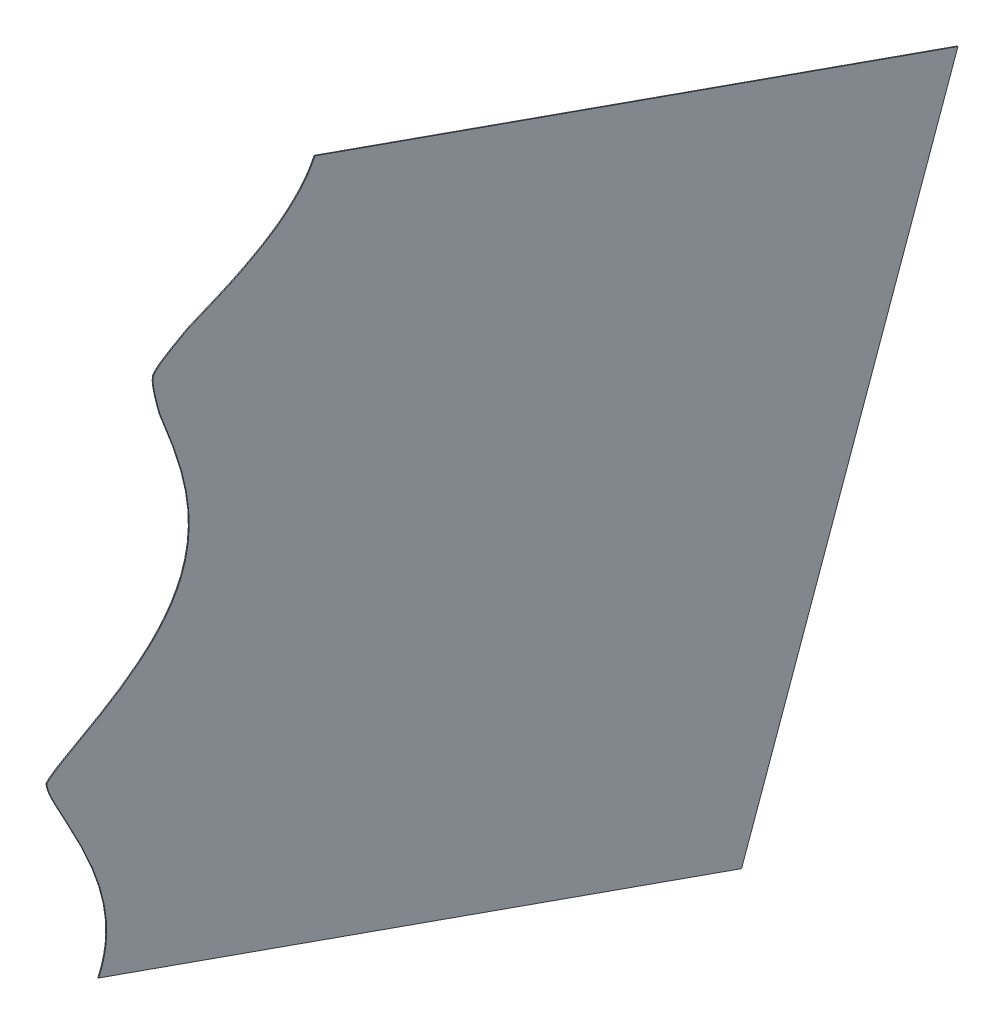
ISO-10303-21;
HEADER;
FILE_DESCRIPTION(('STEP AP214'),'2;1');
FILE_NAME('part.step','',(''),(''),'','','');
FILE_SCHEMA(('AUTOMOTIVE_DESIGN { 1 0 10303 214 1 1 1 1 }'));
ENDSEC;
DATA;
#1=APPLICATION_CONTEXT('core data for automotive mechanical design processes');
#2=APPLICATION_PROTOCOL_DEFINITION('international standard','automotive_design',2000,#1);
#3=PRODUCT_CONTEXT('',#1,'mechanical');
#4=PRODUCT('Part','Part','',(#3));
#5=PRODUCT_RELATED_PRODUCT_CATEGORY('part','',(#4));
#6=PRODUCT_DEFINITION_FORMATION('','',#4);
#7=PRODUCT_DEFINITION_CONTEXT('part definition',#1,'design');
#8=PRODUCT_DEFINITION('design','',#6,#7);
#9=PRODUCT_DEFINITION_SHAPE('','',#8);
#10=(LENGTH_UNIT() NAMED_UNIT(*) SI_UNIT(.MILLI.,.METRE.));
#11=(NAMED_UNIT(*) PLANE_ANGLE_UNIT() SI_UNIT($,.RADIAN.));
#12=(NAMED_UNIT(*) SI_UNIT($,.STERADIAN.) SOLID_ANGLE_UNIT());
#13=UNCERTAINTY_MEASURE_WITH_UNIT(LENGTH_MEASURE(1.E-05),#10,'distance_accuracy_value','');
#14=(GEOMETRIC_REPRESENTATION_CONTEXT(3) GLOBAL_UNCERTAINTY_ASSIGNED_CONTEXT((#13)) GLOBAL_UNIT_ASSIGNED_CONTEXT((#10,
#11,#12)) REPRESENTATION_CONTEXT('',''));
#15=CARTESIAN_POINT('',(0.,0.,0.));
#16=DIRECTION('',(0.,0.,1.));
#17=DIRECTION('',(1.,0.,0.));
#18=AXIS2_PLACEMENT_3D('',#15,#16,#17);
#19=CARTESIAN_POINT('',(2388.98489247794,260.828204022918,107.359488620139));
#20=DIRECTION('',(0.,0.332632387827062,0.943056570184666));
#21=DIRECTION('',(0.,-0.943056570184667,0.332632387827062));
#22=AXIS2_PLACEMENT_3D('',#19,#20,#21);
#23=PLANE('',#22);
#24=DIRECTION('',(0.00396825396825501,0.943049144980878,-0.332629768829067));
#25=VECTOR('',#24,1.);
#26=CARTESIAN_POINT('',(2388.8848932653,260.828578251716,107.359356623159));
#27=LINE('',#26,#25);
#28=CARTESIAN_POINT('',(2388.8848932653,260.828578251716,107.359356623159));
#29=VERTEX_POINT('',#28);
#30=CARTESIAN_POINT('',(2389.19990079326,335.689608388785,80.9545745592258));
#31=VERTEX_POINT('',#30);
#32=EDGE_CURVE('E205',#29,#31,#27,.T.);
#33=ORIENTED_EDGE('',*,*,#32,.T.);
#34=DIRECTION('',(-0.999992126449225,0.00374228797692439,-0.00131996979296459));
#35=VECTOR('',#34,1.);
#36=CARTESIAN_POINT('',(2389.29990000591,335.689234159987,80.9547065562051));
#37=LINE('',#36,#35);
#38=CARTESIAN_POINT('',(2389.29990000591,335.689234159987,80.9547065562051));
#39=VERTEX_POINT('',#38);
#40=EDGE_CURVE('E13',#39,#31,#37,.T.);
#41=ORIENTED_EDGE('',*,*,#40,.F.);
#42=DIRECTION('',(0.00396825396825501,0.943049144980878,-0.332629768829067));
#43=VECTOR('',#42,1.);
#44=CARTESIAN_POINT('',(2388.98489247794,260.828204022918,107.359488620139));
#45=LINE('',#44,#43);
#46=CARTESIAN_POINT('',(2388.98489247794,260.828204022918,107.359488620139));
#47=VERTEX_POINT('',#46);
#48=EDGE_CURVE('E250',#47,#39,#45,.T.);
#49=ORIENTED_EDGE('',*,*,#48,.F.);
#50=DIRECTION('',(-0.999992126449225,0.00374228797692439,-0.00131996979296459));
#51=VECTOR('',#50,1.);
#52=CARTESIAN_POINT('',(2388.98489247794,260.828204022918,107.359488620139));
#53=LINE('',#52,#51);
#54=EDGE_CURVE('E62',#47,#29,#53,.T.);
#55=ORIENTED_EDGE('',*,*,#54,.T.);
#56=EDGE_LOOP('',(#33,#41,#49,#55));
#57=FACE_BOUND('',#56,.T.);
#58=ADVANCED_FACE('F46',(#57),#23,.F.);
#59=CARTESIAN_POINT('',(2389.29990000591,335.689234159987,80.9547065562051));
#60=DIRECTION('',(-0.00396825396825503,-0.943049144980878,0.332629768829066));
#61=DIRECTION('',(0.,-0.332632387827061,-0.943056570184667));
#62=AXIS2_PLACEMENT_3D('',#59,#60,#61);
#63=PLANE('',#62);
#64=DIRECTION('',(0.,0.332632387827061,0.943056570184667));
#65=VECTOR('',#64,1.);
#66=CARTESIAN_POINT('',(2389.19990079326,335.689608388785,80.9545745592258));
#67=LINE('',#66,#65);
#68=CARTESIAN_POINT('',(2389.19990079326,363.686275528078,160.328808263463));
#69=VERTEX_POINT('',#68);
#70=EDGE_CURVE('E198',#31,#69,#67,.T.);
#71=ORIENTED_EDGE('',*,*,#70,.T.);
#72=DIRECTION('',(-0.999992126449225,0.00374228797692439,-0.00131996979296459));
#73=VECTOR('',#72,1.);
#74=CARTESIAN_POINT('',(2389.29990000591,363.68590129928,160.328940260443));
#75=LINE('',#74,#73);
#76=CARTESIAN_POINT('',(2389.29990000591,363.68590129928,160.328940260443));
#77=VERTEX_POINT('',#76);
#78=EDGE_CURVE('E54',#77,#69,#75,.T.);
#79=ORIENTED_EDGE('',*,*,#78,.F.);
#80=DIRECTION('',(0.,0.332632387827061,0.943056570184667));
#81=VECTOR('',#80,1.);
#82=CARTESIAN_POINT('',(2389.29990000591,335.689234159987,80.9547065562051));
#83=LINE('',#82,#81);
#84=EDGE_CURVE('E101',#39,#77,#83,.T.);
#85=ORIENTED_EDGE('',*,*,#84,.F.);
#86=ORIENTED_EDGE('',*,*,#40,.T.);
#87=EDGE_LOOP('',(#71,#79,#85,#86));
#88=FACE_BOUND('',#87,.T.);
#89=ADVANCED_FACE('F192',(#88),#63,.F.);
#90=CARTESIAN_POINT('',(2389.29990000591,363.68590129928,160.328940260443));
#91=CARTESIAN_POINT('',(2389.29523325107,362.61766367174,160.835819482844));
#92=CARTESIAN_POINT('',(2389.28638118449,360.760377319562,162.276380094948));
#93=CARTESIAN_POINT('',(2389.28191766796,359.895959107136,163.207143447417));
#94=CARTESIAN_POINT('',(2389.28149541245,359.814549193409,163.296230973945));
#95=CARTESIAN_POINT('',(2389.27769261612,359.084199882512,164.106544170727));
#96=CARTESIAN_POINT('',(2389.2737824575,358.383934375894,165.083485197727));
#97=CARTESIAN_POINT('',(2389.27340190883,358.316033906257,165.179277211437));
#98=CARTESIAN_POINT('',(2389.26987449496,357.68883783637,166.073417201778));
#99=CARTESIAN_POINT('',(2389.2662074513,357.076196401984,167.114603236392));
#100=CARTESIAN_POINT('',(2389.26585306712,357.017182318013,167.215767443837));
#101=CARTESIAN_POINT('',(2389.26259189758,356.4757470939,168.151347438682));
#102=CARTESIAN_POINT('',(2389.25915072994,355.93373881504,169.221666989572));
#103=CARTESIAN_POINT('',(2389.25881778601,355.881438462559,169.325622651414));
#104=CARTESIAN_POINT('',(2389.25574703409,355.400275766914,170.287825255586));
#105=CARTESIAN_POINT('',(2389.2524082749,354.898703755812,171.395203624688));
#106=CARTESIAN_POINT('',(2389.25209420358,354.851619349471,171.499649524494));
#107=CARTESIAN_POINT('',(2389.24927412569,354.429627696656,172.439702400353));
#108=CARTESIAN_POINT('',(2389.24590287896,353.93911821826,173.603056648517));
#109=CARTESIAN_POINT('',(2389.24440272575,353.721119388439,174.121498054125));
#110=CARTESIAN_POINT('',(2389.24253609449,353.451789905577,174.772049363899));
#111=CARTESIAN_POINT('',(2389.24243021516,353.436512959655,174.808950029483));
#112=CARTESIAN_POINT('',(2389.24094116631,353.221764643998,175.328194555854));
#113=CARTESIAN_POINT('',(2389.23996035606,353.080313711829,175.670211777526));
#114=CARTESIAN_POINT('',(2389.23934328637,352.991114053322,175.884803073919));
#115=B_SPLINE_CURVE_WITH_KNOTS('',2,(#90,#91,#92,#93,#94,#95,#96,#97,#98,#99,#100,#101,#102,
#103,#104,#105,#106,#107,#108,#109,#110,#111,#112,#113,#114),.UNSPECIFIED.,.F.,.F.,(3,1,1,1,1,1,
1,1,1,1,1,1,1,1,1,1,1,1,1,2,2,3),(0.,0.125,0.24375,0.25,0.25625,0.3690625,0.375,0.38125,
0.4940625,0.5,0.50625,0.6190625,0.625,0.63125,0.7440625,0.75,0.75625,0.8690625,0.875,0.9375,
0.96875,1.),.UNSPECIFIED.);
#116=DIRECTION('',(-0.999992126449225,0.00374228797692439,-0.00131996979296459));
#117=VECTOR('',#116,1.);
#118=SURFACE_OF_LINEAR_EXTRUSION('',#115,#117);
#119=CARTESIAN_POINT('',(2389.19990079326,363.686275528078,160.328808263463));
#120=CARTESIAN_POINT('',(2389.19523403842,362.618037900538,160.835687485865));
#121=CARTESIAN_POINT('',(2389.18638197185,360.76075154836,162.276248097969));
#122=CARTESIAN_POINT('',(2389.18191845531,359.896333335934,163.207011450438));
#123=CARTESIAN_POINT('',(2389.1814961998,359.814923422207,163.296098976965));
#124=CARTESIAN_POINT('',(2389.17769340347,359.08457411131,164.106412173748));
#125=CARTESIAN_POINT('',(2389.17378324485,358.384308604691,165.083353200748));
#126=CARTESIAN_POINT('',(2389.17340269618,358.316408135055,165.179145214458));
#127=CARTESIAN_POINT('',(2389.16987528232,357.689212065168,166.073285204798));
#128=CARTESIAN_POINT('',(2389.16620823866,357.076570630781,167.114471239412));
#129=CARTESIAN_POINT('',(2389.16585385447,357.01755654681,167.215635446858));
#130=CARTESIAN_POINT('',(2389.16259268493,356.476121322698,168.151215441702));
#131=CARTESIAN_POINT('',(2389.1591515173,355.934113043838,169.221534992592));
#132=CARTESIAN_POINT('',(2389.15881857336,355.881812691357,169.325490654435));
#133=CARTESIAN_POINT('',(2389.15574782144,355.400649995712,170.287693258606));
#134=CARTESIAN_POINT('',(2389.15240906225,354.89907798461,171.395071627709));
#135=CARTESIAN_POINT('',(2389.15209499094,354.851993578269,171.499517527514));
#136=CARTESIAN_POINT('',(2389.14927491305,354.430001925454,172.439570403374));
#137=CARTESIAN_POINT('',(2389.14590366631,353.939492447057,173.602924651538));
#138=CARTESIAN_POINT('',(2389.14440351311,353.721493617237,174.121366057145));
#139=CARTESIAN_POINT('',(2389.14253688185,353.452164134374,174.77191736692));
#140=CARTESIAN_POINT('',(2389.14243100252,353.436887188452,174.808818032503));
#141=CARTESIAN_POINT('',(2389.14094195366,353.222138872796,175.328062558875));
#142=CARTESIAN_POINT('',(2389.13996114342,353.080687940626,175.670079780546));
#143=CARTESIAN_POINT('',(2389.13934407372,352.991488282119,175.88467107694));
#144=B_SPLINE_CURVE_WITH_KNOTS('',2,(#119,#120,#121,#122,#123,#124,#125,#126,#127,#128,#129,
#130,#131,#132,#133,#134,#135,#136,#137,#138,#139,#140,#141,#142,#143),.UNSPECIFIED.,.F.,.F.,(3,
1,1,1,1,1,1,1,1,1,1,1,1,1,1,1,1,1,1,2,2,3),(0.,0.125,0.24375,0.25,0.25625,0.3690625,0.375,
0.38125,0.4940625,0.5,0.50625,0.6190625,0.625,0.63125,0.7440625,0.75,0.75625,0.8690625,0.875,
0.9375,0.96875,1.),.UNSPECIFIED.);
#145=CARTESIAN_POINT('',(2389.13934408282,352.991489597475,175.884667912536));
#146=VERTEX_POINT('',#145);
#147=EDGE_CURVE('E204',#69,#146,#144,.T.);
#148=ORIENTED_EDGE('',*,*,#147,.T.);
#149=DIRECTION('',(-0.999992126449225,0.00374228797692439,-0.00131996979296459));
#150=VECTOR('',#149,1.);
#151=CARTESIAN_POINT('',(2389.23934329546,352.991115368677,175.884799909515));
#152=LINE('',#151,#150);
#153=CARTESIAN_POINT('',(2389.23934329546,352.991115368677,175.884799909515));
#154=VERTEX_POINT('',#153);
#155=EDGE_CURVE('E209',#154,#146,#152,.T.);
#156=ORIENTED_EDGE('',*,*,#155,.F.);
#157=EDGE_CURVE('E178',#77,#154,#115,.T.);
#158=ORIENTED_EDGE('',*,*,#157,.F.);
#159=ORIENTED_EDGE('',*,*,#78,.T.);
#160=EDGE_LOOP('',(#148,#156,#158,#159));
#161=FACE_BOUND('',#160,.T.);
#162=ADVANCED_FACE('F190',(#161),#118,.F.);
#163=CARTESIAN_POINT('',(2389.23934328637,352.991114053322,175.884803073919));
#164=CARTESIAN_POINT('',(2389.23835790927,352.82949637072,176.173104693514));
#165=CARTESIAN_POINT('',(2389.2362451141,352.482810160307,176.790830110242));
#166=CARTESIAN_POINT('',(2389.23543647603,352.349720601538,177.026117500615));
#167=CARTESIAN_POINT('',(2389.23527640689,352.323369947953,177.072676258046));
#168=CARTESIAN_POINT('',(2389.23302264127,351.952069088723,177.727413306013));
#169=CARTESIAN_POINT('',(2389.23147873666,351.692496363932,178.161132758502));
#170=CARTESIAN_POINT('',(2389.23134756592,351.670408149159,178.197883026729));
#171=CARTESIAN_POINT('',(2389.2302347886,351.482793713238,178.508997200056));
#172=CARTESIAN_POINT('',(2389.22820501722,351.131997908836,179.05217362391));
#173=CARTESIAN_POINT('',(2389.22602185989,350.737415068546,179.587411268851));
#174=CARTESIAN_POINT('',(2389.22367146722,350.278452478336,180.0668191925));
#175=CARTESIAN_POINT('',(2389.22251129413,350.021673085089,180.217748041115));
#176=B_SPLINE_CURVE_WITH_KNOTS('',2,(#163,#164,#165,#166,#167,#168,#169,#170,#171,#172,#173,
#174,#175),.UNSPECIFIED.,.F.,.F.,(3,1,1,1,1,1,1,1,1,1,1,3),(0.,0.125,0.24375,0.25,0.2625,
0.488125,0.5,0.50625,0.625,0.75,0.875,1.),.UNSPECIFIED.);
#177=DIRECTION('',(-0.999992126449225,0.00374228797692439,-0.00131996979296459));
#178=VECTOR('',#177,1.);
#179=SURFACE_OF_LINEAR_EXTRUSION('',#176,#178);
#180=CARTESIAN_POINT('',(2389.13934407372,352.991488282119,175.88467107694));
#181=CARTESIAN_POINT('',(2389.13835869662,352.829870599518,176.172972696535));
#182=CARTESIAN_POINT('',(2389.13624590146,352.483184389105,176.790698113263));
#183=CARTESIAN_POINT('',(2389.13543726339,352.350094830335,177.025985503636));
#184=CARTESIAN_POINT('',(2389.13527719424,352.323744176751,177.072544261067));
#185=CARTESIAN_POINT('',(2389.13302342863,351.95244331752,177.727281309034));
#186=CARTESIAN_POINT('',(2389.13147952401,351.69287059273,178.161000761523));
#187=CARTESIAN_POINT('',(2389.13134835327,351.670782377957,178.197751029749));
#188=CARTESIAN_POINT('',(2389.13023557595,351.483167942035,178.508865203077));
#189=CARTESIAN_POINT('',(2389.12820580458,351.132372137634,179.05204162693));
#190=CARTESIAN_POINT('',(2389.12602264725,350.737789297344,179.587279271872));
#191=CARTESIAN_POINT('',(2389.12367225458,350.278826707134,180.06668719552));
#192=CARTESIAN_POINT('',(2389.12251208149,350.022047313887,180.217616044136));
#193=B_SPLINE_CURVE_WITH_KNOTS('',2,(#180,#181,#182,#183,#184,#185,#186,#187,#188,#189,#190,
#191,#192),.UNSPECIFIED.,.F.,.F.,(3,1,1,1,1,1,1,1,1,1,1,3),(0.,0.125,0.24375,0.25,0.2625,
0.488125,0.5,0.50625,0.625,0.75,0.875,1.),.UNSPECIFIED.);
#194=CARTESIAN_POINT('',(2389.12251208684,350.022048499475,180.217615347275));
#195=VERTEX_POINT('',#194);
#196=EDGE_CURVE('E213',#146,#195,#193,.T.);
#197=ORIENTED_EDGE('',*,*,#196,.T.);
#198=DIRECTION('',(-0.999992126449225,0.00374228797692439,-0.00131996979296459));
#199=VECTOR('',#198,1.);
#200=CARTESIAN_POINT('',(2389.22251129949,350.021674270678,180.217747344254));
#201=LINE('',#200,#199);
#202=CARTESIAN_POINT('',(2389.22251129949,350.021674270678,180.217747344254));
#203=VERTEX_POINT('',#202);
#204=EDGE_CURVE('E254',#203,#195,#201,.T.);
#205=ORIENTED_EDGE('',*,*,#204,.F.);
#206=EDGE_CURVE('E170',#154,#203,#176,.T.);
#207=ORIENTED_EDGE('',*,*,#206,.F.);
#208=ORIENTED_EDGE('',*,*,#155,.T.);
#209=EDGE_LOOP('',(#197,#205,#207,#208));
#210=FACE_BOUND('',#209,.T.);
#211=ADVANCED_FACE('F163',(#210),#179,.F.);
#212=CARTESIAN_POINT('',(2389.22251129413,350.021673085089,180.217748041115));
#213=CARTESIAN_POINT('',(2389.22190619964,349.868653404377,180.242328921215));
#214=CARTESIAN_POINT('',(2389.22036642319,349.461400642515,180.254228598888));
#215=CARTESIAN_POINT('',(2389.21850360469,348.945670033417,180.203311807704));
#216=CARTESIAN_POINT('',(2389.21675343586,348.448122202097,180.11860364437));
#217=CARTESIAN_POINT('',(2389.21501362489,347.945865749465,180.012698937627));
#218=CARTESIAN_POINT('',(2389.21332145455,347.452255914833,179.895216600142));
#219=CARTESIAN_POINT('',(2389.21198992704,347.061591970148,179.796381039704));
#220=CARTESIAN_POINT('',(2389.21108524239,346.795562183911,179.727529052511));
#221=CARTESIAN_POINT('',(2389.20944884457,346.313516370413,179.600579697908));
#222=CARTESIAN_POINT('',(2389.20718184046,345.644023376379,179.419932136712));
#223=B_SPLINE_CURVE_WITH_KNOTS('',2,(#212,#213,#214,#215,#216,#217,#218,#219,#220,#221,#222),
.UNSPECIFIED.,.F.,.F.,(3,1,1,1,1,1,1,1,1,3),(0.,0.072906494140625,0.188793182373047,
0.304679870605469,0.420566558837891,0.536453247070312,0.652339935302734,0.710283279418945,
0.768226623535156,1.),.UNSPECIFIED.);
#224=DIRECTION('',(-0.999992126449225,0.00374228797692439,-0.00131996979296459));
#225=VECTOR('',#224,1.);
#226=SURFACE_OF_LINEAR_EXTRUSION('',#223,#225);
#227=CARTESIAN_POINT('',(2389.12251208149,350.022047313887,180.217616044136));
#228=CARTESIAN_POINT('',(2389.12190698699,349.869027633175,180.242196924236));
#229=CARTESIAN_POINT('',(2389.12036721054,349.461774871313,180.254096601909));
#230=CARTESIAN_POINT('',(2389.11850439204,348.946044262215,180.203179810725));
#231=CARTESIAN_POINT('',(2389.11675422321,348.448496430895,180.118471647391));
#232=CARTESIAN_POINT('',(2389.11501441224,347.946239978262,180.012566940648));
#233=CARTESIAN_POINT('',(2389.11332224191,347.45263014363,179.895084603163));
#234=CARTESIAN_POINT('',(2389.11199071439,347.061966198945,179.796249042724));
#235=CARTESIAN_POINT('',(2389.11108602974,346.795936412708,179.727397055532));
#236=CARTESIAN_POINT('',(2389.10944963192,346.313890599211,179.600447700929));
#237=CARTESIAN_POINT('',(2389.10718262781,345.644397605176,179.419800139733));
#238=B_SPLINE_CURVE_WITH_KNOTS('',2,(#227,#228,#229,#230,#231,#232,#233,#234,#235,#236,#237),
.UNSPECIFIED.,.F.,.F.,(3,1,1,1,1,1,1,1,1,3),(0.,0.072906494140625,0.188793182373047,
0.304679870605469,0.420566558837891,0.536453247070312,0.652339935302734,0.710283279418945,
0.768226623535156,1.),.UNSPECIFIED.);
#239=CARTESIAN_POINT('',(2389.10718263937,345.644401017399,179.419801060444));
#240=VERTEX_POINT('',#239);
#241=EDGE_CURVE('E215',#195,#240,#238,.T.);
#242=ORIENTED_EDGE('',*,*,#241,.T.);
#243=DIRECTION('',(-0.999992126449225,0.00374228797692439,-0.00131996979296459));
#244=VECTOR('',#243,1.);
#245=CARTESIAN_POINT('',(2389.20718185201,345.644026788601,179.419933057423));
#246=LINE('',#245,#244);
#247=CARTESIAN_POINT('',(2389.20718185201,345.644026788601,179.419933057423));
#248=VERTEX_POINT('',#247);
#249=EDGE_CURVE('E135',#248,#240,#246,.T.);
#250=ORIENTED_EDGE('',*,*,#249,.F.);
#251=EDGE_CURVE('E123',#203,#248,#223,.T.);
#252=ORIENTED_EDGE('',*,*,#251,.F.);
#253=ORIENTED_EDGE('',*,*,#204,.T.);
#254=EDGE_LOOP('',(#242,#250,#252,#253));
#255=FACE_BOUND('',#254,.T.);
#256=ADVANCED_FACE('F160',(#255),#226,.F.);
#257=CARTESIAN_POINT('',(2389.20718184046,345.644023376379,179.419932136712));
#258=CARTESIAN_POINT('',(2389.2062537302,345.355715818156,179.305666677203));
#259=CARTESIAN_POINT('',(2389.20426913964,344.737976889298,179.057795826714));
#260=CARTESIAN_POINT('',(2389.20098032499,343.71443087838,178.647471912934));
#261=CARTESIAN_POINT('',(2389.19942697326,343.232601678322,178.458222034831));
#262=CARTESIAN_POINT('',(2389.19735107856,342.588686550415,178.205309053528));
#263=CARTESIAN_POINT('',(2389.19349912887,341.401787764033,177.758482393967));
#264=CARTESIAN_POINT('',(2389.1916106258,340.825247684593,177.554621060325));
#265=CARTESIAN_POINT('',(2389.18734593559,339.523282723312,177.094253563204));
#266=CARTESIAN_POINT('',(2389.18346850337,338.369447786312,176.760472494799));
#267=CARTESIAN_POINT('',(2389.17902078346,337.045908303201,176.377599339737));
#268=CARTESIAN_POINT('',(2389.17483576022,335.843515747091,176.13917803658));
#269=CARTESIAN_POINT('',(2389.17015616375,334.499028121889,175.872580834153));
#270=CARTESIAN_POINT('',(2389.16566697222,333.26622702934,175.778381319854));
#271=CARTESIAN_POINT('',(2389.16074439556,331.914411714612,175.67508781465));
#272=CARTESIAN_POINT('',(2389.1508319602,329.339851347957,175.885404003101));
#273=CARTESIAN_POINT('',(2389.14061797783,326.855608100716,176.580229229978));
#274=CARTESIAN_POINT('',(2389.13045333885,324.556160885727,177.761593601366));
#275=CARTESIAN_POINT('',(2389.12537263216,323.48860692287,178.584015696931));
#276=CARTESIAN_POINT('',(2389.12066915084,322.500315247673,179.345375720708));
#277=CARTESIAN_POINT('',(2389.11581438027,321.549178972353,180.326690975907));
#278=CARTESIAN_POINT('',(2389.11144579151,320.693294396801,181.2097322524));
#279=CARTESIAN_POINT('',(2389.10686493617,319.849968540378,182.28918957635));
#280=CARTESIAN_POINT('',(2389.10278032194,319.09799963188,183.251709982288));
#281=CARTESIAN_POINT('',(2389.09839828725,318.332463305732,184.401086894852));
#282=CARTESIAN_POINT('',(2389.09461533213,317.67158548057,185.393329442098));
#283=CARTESIAN_POINT('',(2389.09035639153,316.956519559257,186.592542089496));
#284=CARTESIAN_POINT('',(2389.08851527526,316.647400550393,187.110955027284));
#285=CARTESIAN_POINT('',(2389.08645043261,316.305468381355,187.705830570943));
#286=CARTESIAN_POINT('',(2389.08477171298,316.02747710438,188.189465124803));
#287=CARTESIAN_POINT('',(2389.08257505941,315.666703689569,188.830781514214));
#288=CARTESIAN_POINT('',(2389.08190889735,315.557294738602,189.025268553786));
#289=CARTESIAN_POINT('',(2389.07931793535,315.132289959604,189.783203568562));
#290=CARTESIAN_POINT('',(2389.07869230152,315.029514746049,189.965794452161));
#291=CARTESIAN_POINT('',(2389.07628554767,314.634148267761,190.668204227044));
#292=CARTESIAN_POINT('',(2389.07477657478,314.382318789499,191.097412977524));
#293=CARTESIAN_POINT('',(2389.07240034268,313.985754152133,191.773302923624));
#294=CARTESIAN_POINT('',(2389.07074115099,313.694195502596,192.203678071363));
#295=CARTESIAN_POINT('',(2389.06958336667,313.490745813124,192.503993943667));
#296=CARTESIAN_POINT('',(2389.06736760872,313.079050297035,193.015412708492));
#297=CARTESIAN_POINT('',(2389.06631086814,312.863145543161,193.203867403083));
#298=B_SPLINE_CURVE_WITH_KNOTS('',2,(#257,#258,#259,#260,#261,#262,#263,#264,#265,#266,#267,
#268,#269,#270,#271,#272,#273,#274,#275,#276,#277,#278,#279,#280,#281,#282,#283,#284,#285,#286,
#287,#288,#289,#290,#291,#292,#293,#294,#295,#296,#297),.UNSPECIFIED.,.F.,.F.,(3,1,1,2,1,2,2,2,
2,1,1,1,2,2,2,2,2,2,2,1,2,2,2,1,3),(0.,0.015625,0.03125,0.0625,0.09375,0.125,0.1875,0.25,0.3125,
0.375,0.4375,0.5,0.5625,0.625,0.6875,0.75,0.8125,0.84375,0.875,0.890625,0.90625,0.9375,0.96875,
0.984375,1.),.UNSPECIFIED.);
#299=DIRECTION('',(-0.999992126449225,0.00374228797692439,-0.00131996979296459));
#300=VECTOR('',#299,1.);
#301=SURFACE_OF_LINEAR_EXTRUSION('',#298,#300);
#302=CARTESIAN_POINT('',(2389.10718262781,345.644397605176,179.419800139733));
#303=CARTESIAN_POINT('',(2389.10625451755,345.356090046954,179.305534680224));
#304=CARTESIAN_POINT('',(2389.10426992699,344.738351118096,179.057663829735));
#305=CARTESIAN_POINT('',(2389.10098111234,343.714805107178,178.647339915954));
#306=CARTESIAN_POINT('',(2389.09942776061,343.23297590712,178.458090037851));
#307=CARTESIAN_POINT('',(2389.09735186592,342.589060779213,178.205177056549));
#308=CARTESIAN_POINT('',(2389.09349991623,341.402161992831,177.758350396987));
#309=CARTESIAN_POINT('',(2389.09161141315,340.825621913391,177.554489063345));
#310=CARTESIAN_POINT('',(2389.08734672294,339.52365695211,177.094121566225));
#311=CARTESIAN_POINT('',(2389.08346929073,338.369822015109,176.760340497819));
#312=CARTESIAN_POINT('',(2389.07902157081,337.046282531998,176.377467342758));
#313=CARTESIAN_POINT('',(2389.07483654758,335.843889975888,176.139046039601));
#314=CARTESIAN_POINT('',(2389.07015695111,334.499402350686,175.872448837173));
#315=CARTESIAN_POINT('',(2389.06566775957,333.266601258138,175.778249322875));
#316=CARTESIAN_POINT('',(2389.06074518292,331.91478594341,175.674955817671));
#317=CARTESIAN_POINT('',(2389.05083274755,329.340225576755,175.885272006121));
#318=CARTESIAN_POINT('',(2389.04061876518,326.855982329513,176.580097232998));
#319=CARTESIAN_POINT('',(2389.0304541262,324.556535114525,177.761461604387));
#320=CARTESIAN_POINT('',(2389.02537341952,323.488981151667,178.583883699951));
#321=CARTESIAN_POINT('',(2389.0206699382,322.50068947647,179.345243723729));
#322=CARTESIAN_POINT('',(2389.01581516763,321.54955320115,180.326558978927));
#323=CARTESIAN_POINT('',(2389.01144657887,320.693668625599,181.20960025542));
#324=CARTESIAN_POINT('',(2389.00686572352,319.850342769176,182.289057579371));
#325=CARTESIAN_POINT('',(2389.0027811093,319.098373860678,183.251577985309));
#326=CARTESIAN_POINT('',(2388.9983990746,318.33283753453,184.400954897873));
#327=CARTESIAN_POINT('',(2388.99461611949,317.671959709368,185.393197445119));
#328=CARTESIAN_POINT('',(2388.99035717888,316.956893788054,186.592410092517));
#329=CARTESIAN_POINT('',(2388.98851606262,316.647774779191,187.110823030305));
#330=CARTESIAN_POINT('',(2388.98645121997,316.305842610153,187.705698573963));
#331=CARTESIAN_POINT('',(2388.98477250034,316.027851333178,188.189333127823));
#332=CARTESIAN_POINT('',(2388.98257584677,315.667077918366,188.830649517234));
#333=CARTESIAN_POINT('',(2388.9819096847,315.5576689674,189.025136556806));
#334=CARTESIAN_POINT('',(2388.9793187227,315.132664188401,189.783071571583));
#335=CARTESIAN_POINT('',(2388.97869308888,315.029888974847,189.965662455182));
#336=CARTESIAN_POINT('',(2388.97628633503,314.634522496559,190.668072230065));
#337=CARTESIAN_POINT('',(2388.97477736213,314.382693018297,191.097280980545));
#338=CARTESIAN_POINT('',(2388.97240113004,313.986128380931,191.773170926645));
#339=CARTESIAN_POINT('',(2388.97074193835,313.694569731394,192.203546074383));
#340=CARTESIAN_POINT('',(2388.96958415403,313.491120041922,192.503861946688));
#341=CARTESIAN_POINT('',(2388.96736839608,313.079424525833,193.015280711513));
#342=CARTESIAN_POINT('',(2388.96631165549,312.863519771959,193.203735406103));
#343=B_SPLINE_CURVE_WITH_KNOTS('',2,(#302,#303,#304,#305,#306,#307,#308,#309,#310,#311,#312,
#313,#314,#315,#316,#317,#318,#319,#320,#321,#322,#323,#324,#325,#326,#327,#328,#329,#330,#331,
#332,#333,#334,#335,#336,#337,#338,#339,#340,#341,#342),.UNSPECIFIED.,.F.,.F.,(3,1,1,2,1,2,2,2,
2,1,1,1,2,2,2,2,2,2,2,1,2,2,2,1,3),(0.,0.015625,0.03125,0.0625,0.09375,0.125,0.1875,0.25,0.3125,
0.375,0.4375,0.5,0.5625,0.625,0.6875,0.75,0.8125,0.84375,0.875,0.890625,0.90625,0.9375,0.96875,
0.984375,1.),.UNSPECIFIED.);
#344=CARTESIAN_POINT('',(2388.96631165811,312.863520306885,193.203734939188));
#345=VERTEX_POINT('',#344);
#346=EDGE_CURVE('E132',#240,#345,#343,.T.);
#347=ORIENTED_EDGE('',*,*,#346,.T.);
#348=DIRECTION('',(-0.999992126449225,0.00374228797692439,-0.00131996979296459));
#349=VECTOR('',#348,1.);
#350=CARTESIAN_POINT('',(2389.06631087075,312.863146078087,193.203866936167));
#351=LINE('',#350,#349);
#352=CARTESIAN_POINT('',(2389.06631087075,312.863146078087,193.203866936167));
#353=VERTEX_POINT('',#352);
#354=EDGE_CURVE('E129',#353,#345,#351,.T.);
#355=ORIENTED_EDGE('',*,*,#354,.F.);
#356=EDGE_CURVE('E116',#248,#353,#298,.T.);
#357=ORIENTED_EDGE('',*,*,#356,.F.);
#358=ORIENTED_EDGE('',*,*,#249,.T.);
#359=EDGE_LOOP('',(#347,#355,#357,#358));
#360=FACE_BOUND('',#359,.T.);
#361=ADVANCED_FACE('F130',(#360),#301,.F.);
#362=CARTESIAN_POINT('',(2389.06631086814,312.86314554316,193.203867403083));
#363=CARTESIAN_POINT('',(2389.06562264816,312.675013559243,193.191875077728));
#364=CARTESIAN_POINT('',(2389.06425950837,312.279758724397,193.103972793534));
#365=CARTESIAN_POINT('',(2389.06247929752,311.741943594086,192.927860989863));
#366=CARTESIAN_POINT('',(2389.06114574029,311.319377355363,192.740115921327));
#367=CARTESIAN_POINT('',(2389.06012776776,310.996810906234,192.596800496313));
#368=CARTESIAN_POINT('',(2389.05790292647,310.275115659008,192.236210670293));
#369=CARTESIAN_POINT('',(2389.05669458046,309.878417917306,192.026947780154));
#370=CARTESIAN_POINT('',(2389.05506363355,309.342981085906,191.744498330493));
#371=CARTESIAN_POINT('',(2389.0524046167,308.462495115825,191.262641733461));
#372=CARTESIAN_POINT('',(2389.05133697755,308.108965465627,191.069168356277));
#373=CARTESIAN_POINT('',(2389.04905550476,307.353790391926,190.656562115211));
#374=CARTESIAN_POINT('',(2389.04813773982,307.050544465134,190.492106934715));
#375=CARTESIAN_POINT('',(2389.04578891401,306.27445047086,190.071218584258));
#376=CARTESIAN_POINT('',(2389.04385909173,305.641430216998,189.73853142784));
#377=CARTESIAN_POINT('',(2389.04158374988,304.895072641899,189.346279240305));
#378=CARTESIAN_POINT('',(2389.0392785622,304.147359033718,188.972793329323));
#379=CARTESIAN_POINT('',(2389.0347469952,302.679643972293,188.244684919031));
#380=CARTESIAN_POINT('',(2389.0306492342,301.391334779539,187.696569899188));
#381=CARTESIAN_POINT('',(2389.03019009895,301.247240073131,187.635877414001));
#382=CARTESIAN_POINT('',(2389.02534149237,299.72892231586,187.004488812309));
#383=CARTESIAN_POINT('',(2389.02079282209,298.365319729898,186.584510188409));
#384=CARTESIAN_POINT('',(2389.02028787581,298.21432555648,186.538962648779));
#385=CARTESIAN_POINT('',(2389.01499856843,296.637550725916,186.075709801843));
#386=CARTESIAN_POINT('',(2389.00993393844,295.215939278315,185.882152865351));
#387=CARTESIAN_POINT('',(2389.00937669683,295.06005797179,185.862367932456));
#388=CARTESIAN_POINT('',(2389.0035821015,293.445794118869,185.675628427663));
#389=CARTESIAN_POINT('',(2388.99793530079,291.993492629946,185.836106225763));
#390=CARTESIAN_POINT('',(2388.99733357379,291.839428582238,185.855175020824));
#391=CARTESIAN_POINT('',(2388.99094028638,290.210888778133,186.081522732231));
#392=CARTESIAN_POINT('',(2388.98489247794,288.821551026136,186.724309301907));
#393=B_SPLINE_CURVE_WITH_KNOTS('',2,(#362,#363,#364,#365,#366,#367,#368,#369,#370,#371,#372,
#373,#374,#375,#376,#377,#378,#379,#380,#381,#382,#383,#384,#385,#386,#387,#388,#389,#390,#391,
#392),.UNSPECIFIED.,.F.,.F.,(3,1,1,2,1,2,2,1,2,2,1,1,1,1,1,1,1,1,1,1,1,1,1,1,3),(0.,0.015625,
0.03125,0.0625,0.09375,0.125,0.1875,0.21875,0.25,0.3125,0.375,0.38125,0.4940625,0.5,0.50625,
0.6190625,0.625,0.63125,0.7440625,0.75,0.75625,0.8690625,0.875,0.88125,1.),.UNSPECIFIED.);
#394=DIRECTION('',(-0.999992126449225,0.00374228797692439,-0.00131996979296459));
#395=VECTOR('',#394,1.);
#396=SURFACE_OF_LINEAR_EXTRUSION('',#393,#395);
#397=CARTESIAN_POINT('',(2388.96631165549,312.863519771958,193.203735406103));
#398=CARTESIAN_POINT('',(2388.96562343552,312.67538778804,193.191743080749));
#399=CARTESIAN_POINT('',(2388.96426029573,312.280132953195,193.103840796555));
#400=CARTESIAN_POINT('',(2388.96248008488,311.742317822884,192.927728992883));
#401=CARTESIAN_POINT('',(2388.96114652764,311.319751584161,192.739983924348));
#402=CARTESIAN_POINT('',(2388.96012855511,310.997185135032,192.596668499334));
#403=CARTESIAN_POINT('',(2388.95790371383,310.275489887806,192.236078673314));
#404=CARTESIAN_POINT('',(2388.95669536782,309.878792146104,192.026815783175));
#405=CARTESIAN_POINT('',(2388.9550644209,309.343355314704,191.744366333514));
#406=CARTESIAN_POINT('',(2388.95240540406,308.462869344623,191.262509736482));
#407=CARTESIAN_POINT('',(2388.95133776491,308.109339694424,191.069036359298));
#408=CARTESIAN_POINT('',(2388.94905629212,307.354164620724,190.656430118232));
#409=CARTESIAN_POINT('',(2388.94813852718,307.050918693932,190.491974937736));
#410=CARTESIAN_POINT('',(2388.94578970137,306.274824699657,190.071086587279));
#411=CARTESIAN_POINT('',(2388.94385987909,305.641804445795,189.738399430861));
#412=CARTESIAN_POINT('',(2388.94158453723,304.895446870696,189.346147243326));
#413=CARTESIAN_POINT('',(2388.93927934955,304.147733262516,188.972661332344));
#414=CARTESIAN_POINT('',(2388.93474778255,302.680018201091,188.244552922052));
#415=CARTESIAN_POINT('',(2388.93065002156,301.391709008336,187.696437902209));
#416=CARTESIAN_POINT('',(2388.9301908863,301.247614301928,187.635745417022));
#417=CARTESIAN_POINT('',(2388.92534227972,299.729296544657,187.00435681533));
#418=CARTESIAN_POINT('',(2388.92079360944,298.365693958696,186.584378191429));
#419=CARTESIAN_POINT('',(2388.92028866316,298.214699785278,186.5388306518));
#420=CARTESIAN_POINT('',(2388.91499935579,296.637924954714,186.075577804864));
#421=CARTESIAN_POINT('',(2388.90993472579,295.216313507112,185.882020868371));
#422=CARTESIAN_POINT('',(2388.90937748418,295.060432200588,185.862235935477));
#423=CARTESIAN_POINT('',(2388.90358288885,293.446168347666,185.675496430684));
#424=CARTESIAN_POINT('',(2388.89793608815,291.993866858744,185.835974228784));
#425=CARTESIAN_POINT('',(2388.89733436114,291.839802811036,185.855043023845));
#426=CARTESIAN_POINT('',(2388.89094107373,290.211263006931,186.081390735252));
#427=CARTESIAN_POINT('',(2388.8848932653,288.821925254933,186.724177304928));
#428=B_SPLINE_CURVE_WITH_KNOTS('',2,(#397,#398,#399,#400,#401,#402,#403,#404,#405,#406,#407,
#408,#409,#410,#411,#412,#413,#414,#415,#416,#417,#418,#419,#420,#421,#422,#423,#424,#425,#426,
#427),.UNSPECIFIED.,.F.,.F.,(3,1,1,2,1,2,2,1,2,2,1,1,1,1,1,1,1,1,1,1,1,1,1,1,3),(0.,0.015625,
0.03125,0.0625,0.09375,0.125,0.1875,0.21875,0.25,0.3125,0.375,0.38125,0.4940625,0.5,0.50625,
0.6190625,0.625,0.63125,0.7440625,0.75,0.75625,0.8690625,0.875,0.88125,1.),.UNSPECIFIED.);
#429=CARTESIAN_POINT('',(2388.8848932653,288.821925254933,186.724177304928));
#430=VERTEX_POINT('',#429);
#431=EDGE_CURVE('E237',#345,#430,#428,.T.);
#432=ORIENTED_EDGE('',*,*,#431,.T.);
#433=DIRECTION('',(-0.999992126449225,0.00374228797692439,-0.00131996979296459));
#434=VECTOR('',#433,1.);
#435=CARTESIAN_POINT('',(2388.98489247794,288.821551026136,186.724309301907));
#436=LINE('',#435,#434);
#437=CARTESIAN_POINT('',(2388.98489247794,288.821551026136,186.724309301907));
#438=VERTEX_POINT('',#437);
#439=EDGE_CURVE('E89',#438,#430,#436,.T.);
#440=ORIENTED_EDGE('',*,*,#439,.F.);
#441=EDGE_CURVE('E121',#353,#438,#393,.T.);
#442=ORIENTED_EDGE('',*,*,#441,.F.);
#443=ORIENTED_EDGE('',*,*,#354,.T.);
#444=EDGE_LOOP('',(#432,#440,#442,#443));
#445=FACE_BOUND('',#444,.T.);
#446=ADVANCED_FACE('F137',(#445),#396,.F.);
#447=CARTESIAN_POINT('',(2388.98489247794,260.828204022918,107.359488620139));
#448=DIRECTION('',(-0.00396825396825503,-0.943049144980878,0.332629768829067));
#449=DIRECTION('',(0.,-0.332632387827062,-0.943056570184667));
#450=AXIS2_PLACEMENT_3D('',#447,#448,#449);
#451=PLANE('',#450);
#452=DIRECTION('',(0.,0.332632387827062,0.943056570184667));
#453=VECTOR('',#452,1.);
#454=CARTESIAN_POINT('',(2388.8848932653,260.828578251716,107.359356623159));
#455=LINE('',#454,#453);
#456=EDGE_CURVE('E244',#29,#430,#455,.T.);
#457=ORIENTED_EDGE('',*,*,#456,.F.);
#458=ORIENTED_EDGE('',*,*,#54,.F.);
#459=DIRECTION('',(0.,0.332632387827062,0.943056570184667));
#460=VECTOR('',#459,1.);
#461=CARTESIAN_POINT('',(2388.98489247794,260.828204022918,107.359488620139));
#462=LINE('',#461,#460);
#463=EDGE_CURVE('E138',#47,#438,#462,.T.);
#464=ORIENTED_EDGE('',*,*,#463,.T.);
#465=ORIENTED_EDGE('',*,*,#439,.T.);
#466=EDGE_LOOP('',(#457,#458,#464,#465));
#467=FACE_BOUND('',#466,.T.);
#468=ADVANCED_FACE('F156',(#467),#451,.T.);
#469=CARTESIAN_POINT('',(2393.22721609372,939.808720921498,-1181.57121096124));
#470=DIRECTION('',(0.999992126449225,-0.00374228797692505,0.00131996979296516));
#471=DIRECTION('',(0.00374229123706138,0.999992997603632,0.));
#472=AXIS2_PLACEMENT_3D('',#469,#470,#471);
#473=PLANE('',#472);
#474=ORIENTED_EDGE('',*,*,#48,.T.);
#475=ORIENTED_EDGE('',*,*,#84,.T.);
#476=ORIENTED_EDGE('',*,*,#157,.T.);
#477=ORIENTED_EDGE('',*,*,#206,.T.);
#478=ORIENTED_EDGE('',*,*,#251,.T.);
#479=ORIENTED_EDGE('',*,*,#356,.T.);
#480=ORIENTED_EDGE('',*,*,#441,.T.);
#481=ORIENTED_EDGE('',*,*,#463,.F.);
#482=EDGE_LOOP('',(#474,#475,#476,#477,#478,#479,#480,#481));
#483=FACE_BOUND('',#482,.T.);
#484=ADVANCED_FACE('F118',(#483),#473,.T.);
#485=CARTESIAN_POINT('',(2393.12721688108,939.809095150296,-1181.57134295822));
#486=DIRECTION('',(0.999992126449225,-0.00374228797692505,0.00131996979296516));
#487=DIRECTION('',(0.00374229123706138,0.999992997603632,0.));
#488=AXIS2_PLACEMENT_3D('',#485,#486,#487);
#489=PLANE('',#488);
#490=ORIENTED_EDGE('',*,*,#32,.F.);
#491=ORIENTED_EDGE('',*,*,#456,.T.);
#492=ORIENTED_EDGE('',*,*,#431,.F.);
#493=ORIENTED_EDGE('',*,*,#346,.F.);
#494=ORIENTED_EDGE('',*,*,#241,.F.);
#495=ORIENTED_EDGE('',*,*,#196,.F.);
#496=ORIENTED_EDGE('',*,*,#147,.F.);
#497=ORIENTED_EDGE('',*,*,#70,.F.);
#498=EDGE_LOOP('',(#490,#491,#492,#493,#494,#495,#496,#497));
#499=FACE_BOUND('',#498,.T.);
#500=ADVANCED_FACE('F211',(#499),#489,.F.);
#501=CLOSED_SHELL('',(#58,#89,#162,#211,#256,#361,#446,#468,#484,#500));
#502=MANIFOLD_SOLID_BREP('B2',#501);
#503=ADVANCED_BREP_SHAPE_REPRESENTATION('',(#18,#502),#14);
#504=SHAPE_DEFINITION_REPRESENTATION(#9,#503);
ENDSEC;
END-ISO-10303-21;
